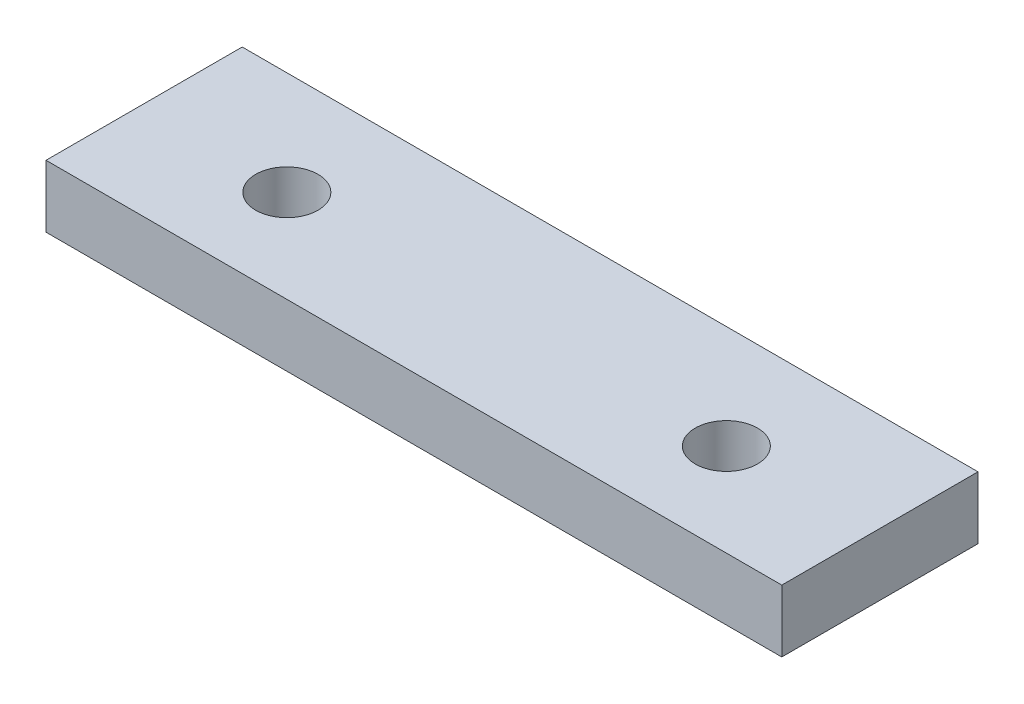
ISO-10303-21;
HEADER;
FILE_DESCRIPTION(('STEP AP214'),'2;1');
FILE_NAME('part.step','',(''),(''),'','','');
FILE_SCHEMA(('AUTOMOTIVE_DESIGN { 1 0 10303 214 1 1 1 1 }'));
ENDSEC;
DATA;
#1=APPLICATION_CONTEXT('core data for automotive mechanical design processes');
#2=APPLICATION_PROTOCOL_DEFINITION('international standard','automotive_design',2000,#1);
#3=PRODUCT_CONTEXT('',#1,'mechanical');
#4=PRODUCT('Part','Part','',(#3));
#5=PRODUCT_RELATED_PRODUCT_CATEGORY('part','',(#4));
#6=PRODUCT_DEFINITION_FORMATION('','',#4);
#7=PRODUCT_DEFINITION_CONTEXT('part definition',#1,'design');
#8=PRODUCT_DEFINITION('design','',#6,#7);
#9=PRODUCT_DEFINITION_SHAPE('','',#8);
#10=(LENGTH_UNIT() NAMED_UNIT(*) SI_UNIT(.MILLI.,.METRE.));
#11=(NAMED_UNIT(*) PLANE_ANGLE_UNIT() SI_UNIT($,.RADIAN.));
#12=(NAMED_UNIT(*) SI_UNIT($,.STERADIAN.) SOLID_ANGLE_UNIT());
#13=UNCERTAINTY_MEASURE_WITH_UNIT(LENGTH_MEASURE(1.E-05),#10,'distance_accuracy_value','');
#14=(GEOMETRIC_REPRESENTATION_CONTEXT(3) GLOBAL_UNCERTAINTY_ASSIGNED_CONTEXT((#13)) GLOBAL_UNIT_ASSIGNED_CONTEXT((#10,
#11,#12)) REPRESENTATION_CONTEXT('',''));
#15=CARTESIAN_POINT('',(0.,0.,0.));
#16=DIRECTION('',(0.,0.,1.));
#17=DIRECTION('',(1.,0.,0.));
#18=AXIS2_PLACEMENT_3D('',#15,#16,#17);
#19=CARTESIAN_POINT('',(150.,0.,0.));
#20=DIRECTION('',(0.,0.,-1.));
#21=DIRECTION('',(-1.,0.,0.));
#22=AXIS2_PLACEMENT_3D('',#19,#20,#21);
#23=PLANE('',#22);
#24=DIRECTION('',(0.,-1.,0.));
#25=VECTOR('',#24,1.);
#26=CARTESIAN_POINT('',(0.,0.,0.));
#27=LINE('',#26,#25);
#28=CARTESIAN_POINT('',(0.,12.7,0.));
#29=VERTEX_POINT('',#28);
#30=CARTESIAN_POINT('',(0.,0.,0.));
#31=VERTEX_POINT('',#30);
#32=EDGE_CURVE('E101',#29,#31,#27,.T.);
#33=ORIENTED_EDGE('',*,*,#32,.T.);
#34=DIRECTION('',(-1.,0.,0.));
#35=VECTOR('',#34,1.);
#36=CARTESIAN_POINT('',(150.,0.,0.));
#37=LINE('',#36,#35);
#38=CARTESIAN_POINT('',(150.,0.,0.));
#39=VERTEX_POINT('',#38);
#40=EDGE_CURVE('E11',#39,#31,#37,.T.);
#41=ORIENTED_EDGE('',*,*,#40,.F.);
#42=DIRECTION('',(0.,-1.,0.));
#43=VECTOR('',#42,1.);
#44=CARTESIAN_POINT('',(150.,0.,0.));
#45=LINE('',#44,#43);
#46=CARTESIAN_POINT('',(150.,12.7,0.));
#47=VERTEX_POINT('',#46);
#48=EDGE_CURVE('E89',#47,#39,#45,.T.);
#49=ORIENTED_EDGE('',*,*,#48,.F.);
#50=DIRECTION('',(-1.,0.,0.));
#51=VECTOR('',#50,1.);
#52=CARTESIAN_POINT('',(150.,12.7,0.));
#53=LINE('',#52,#51);
#54=EDGE_CURVE('E97',#47,#29,#53,.T.);
#55=ORIENTED_EDGE('',*,*,#54,.T.);
#56=EDGE_LOOP('',(#33,#41,#49,#55));
#57=FACE_BOUND('',#56,.T.);
#58=ADVANCED_FACE('F38',(#57),#23,.F.);
#59=CARTESIAN_POINT('',(150.,0.,0.));
#60=DIRECTION('',(0.,1.,0.));
#61=DIRECTION('',(0.,0.,1.));
#62=AXIS2_PLACEMENT_3D('',#59,#60,#61);
#63=PLANE('',#62);
#64=CARTESIAN_POINT('',(30.2,0.,-18.9));
#65=DIRECTION('',(0.,1.,0.));
#66=DIRECTION('',(0.,0.,1.));
#67=AXIS2_PLACEMENT_3D('',#64,#65,#66);
#68=CIRCLE('',#67,6.35000000000001);
#69=CARTESIAN_POINT('',(30.2,0.,-12.55));
#70=VERTEX_POINT('',#69);
#71=EDGE_CURVE('E104',#70,#70,#68,.F.);
#72=ORIENTED_EDGE('',*,*,#71,.F.);
#73=EDGE_LOOP('',(#72));
#74=FACE_BOUND('',#73,.T.);
#75=CARTESIAN_POINT('',(119.8,0.,-18.9));
#76=DIRECTION('',(0.,1.,0.));
#77=DIRECTION('',(0.,0.,1.));
#78=AXIS2_PLACEMENT_3D('',#75,#76,#77);
#79=CIRCLE('',#78,6.35);
#80=CARTESIAN_POINT('',(119.8,0.,-12.55));
#81=VERTEX_POINT('',#80);
#82=EDGE_CURVE('E115',#81,#81,#79,.F.);
#83=ORIENTED_EDGE('',*,*,#82,.F.);
#84=EDGE_LOOP('',(#83));
#85=FACE_BOUND('',#84,.T.);
#86=DIRECTION('',(0.,0.,-1.));
#87=VECTOR('',#86,1.);
#88=CARTESIAN_POINT('',(0.,0.,0.));
#89=LINE('',#88,#87);
#90=CARTESIAN_POINT('',(0.,0.,-40.));
#91=VERTEX_POINT('',#90);
#92=EDGE_CURVE('E93',#31,#91,#89,.T.);
#93=ORIENTED_EDGE('',*,*,#92,.T.);
#94=DIRECTION('',(-1.,0.,0.));
#95=VECTOR('',#94,1.);
#96=CARTESIAN_POINT('',(150.,0.,-40.));
#97=LINE('',#96,#95);
#98=CARTESIAN_POINT('',(150.,0.,-40.));
#99=VERTEX_POINT('',#98);
#100=EDGE_CURVE('E46',#99,#91,#97,.T.);
#101=ORIENTED_EDGE('',*,*,#100,.F.);
#102=DIRECTION('',(0.,0.,-1.));
#103=VECTOR('',#102,1.);
#104=CARTESIAN_POINT('',(150.,0.,0.));
#105=LINE('',#104,#103);
#106=EDGE_CURVE('E84',#39,#99,#105,.T.);
#107=ORIENTED_EDGE('',*,*,#106,.F.);
#108=ORIENTED_EDGE('',*,*,#40,.T.);
#109=EDGE_LOOP('',(#93,#101,#107,#108));
#110=FACE_BOUND('',#109,.T.);
#111=ADVANCED_FACE('F92',(#74,#85,#110),#63,.F.);
#112=CARTESIAN_POINT('',(150.,0.,-40.));
#113=DIRECTION('',(0.,0.,1.));
#114=DIRECTION('',(1.,0.,0.));
#115=AXIS2_PLACEMENT_3D('',#112,#113,#114);
#116=PLANE('',#115);
#117=DIRECTION('',(0.,1.,0.));
#118=VECTOR('',#117,1.);
#119=CARTESIAN_POINT('',(0.,0.,-40.));
#120=LINE('',#119,#118);
#121=CARTESIAN_POINT('',(0.,12.7,-40.));
#122=VERTEX_POINT('',#121);
#123=EDGE_CURVE('E71',#91,#122,#120,.T.);
#124=ORIENTED_EDGE('',*,*,#123,.T.);
#125=DIRECTION('',(-1.,0.,0.));
#126=VECTOR('',#125,1.);
#127=CARTESIAN_POINT('',(150.,12.7,-40.));
#128=LINE('',#127,#126);
#129=CARTESIAN_POINT('',(150.,12.7,-40.));
#130=VERTEX_POINT('',#129);
#131=EDGE_CURVE('E94',#130,#122,#128,.T.);
#132=ORIENTED_EDGE('',*,*,#131,.F.);
#133=DIRECTION('',(0.,1.,0.));
#134=VECTOR('',#133,1.);
#135=CARTESIAN_POINT('',(150.,0.,-40.));
#136=LINE('',#135,#134);
#137=EDGE_CURVE('E87',#99,#130,#136,.T.);
#138=ORIENTED_EDGE('',*,*,#137,.F.);
#139=ORIENTED_EDGE('',*,*,#100,.T.);
#140=EDGE_LOOP('',(#124,#132,#138,#139));
#141=FACE_BOUND('',#140,.T.);
#142=ADVANCED_FACE('F95',(#141),#116,.F.);
#143=CARTESIAN_POINT('',(150.,12.7,0.));
#144=DIRECTION('',(0.,-1.,0.));
#145=DIRECTION('',(0.,0.,-1.));
#146=AXIS2_PLACEMENT_3D('',#143,#144,#145);
#147=PLANE('',#146);
#148=CARTESIAN_POINT('',(30.2,12.7,-18.9));
#149=DIRECTION('',(0.,1.,0.));
#150=DIRECTION('',(0.,0.,1.));
#151=AXIS2_PLACEMENT_3D('',#148,#149,#150);
#152=CIRCLE('',#151,6.35000000000001);
#153=CARTESIAN_POINT('',(30.2,12.7,-12.55));
#154=VERTEX_POINT('',#153);
#155=EDGE_CURVE('E118',#154,#154,#152,.T.);
#156=ORIENTED_EDGE('',*,*,#155,.F.);
#157=EDGE_LOOP('',(#156));
#158=FACE_BOUND('',#157,.T.);
#159=CARTESIAN_POINT('',(119.8,12.7,-18.9));
#160=DIRECTION('',(0.,1.,0.));
#161=DIRECTION('',(0.,0.,1.));
#162=AXIS2_PLACEMENT_3D('',#159,#160,#161);
#163=CIRCLE('',#162,6.35);
#164=CARTESIAN_POINT('',(119.8,12.7,-12.55));
#165=VERTEX_POINT('',#164);
#166=EDGE_CURVE('E119',#165,#165,#163,.T.);
#167=ORIENTED_EDGE('',*,*,#166,.F.);
#168=EDGE_LOOP('',(#167));
#169=FACE_BOUND('',#168,.T.);
#170=DIRECTION('',(0.,0.,1.));
#171=VECTOR('',#170,1.);
#172=CARTESIAN_POINT('',(0.,12.7,0.));
#173=LINE('',#172,#171);
#174=EDGE_CURVE('E77',#122,#29,#173,.T.);
#175=ORIENTED_EDGE('',*,*,#174,.T.);
#176=ORIENTED_EDGE('',*,*,#54,.F.);
#177=DIRECTION('',(0.,0.,1.));
#178=VECTOR('',#177,1.);
#179=CARTESIAN_POINT('',(150.,12.7,0.));
#180=LINE('',#179,#178);
#181=EDGE_CURVE('E54',#130,#47,#180,.T.);
#182=ORIENTED_EDGE('',*,*,#181,.F.);
#183=ORIENTED_EDGE('',*,*,#131,.T.);
#184=EDGE_LOOP('',(#175,#176,#182,#183));
#185=FACE_BOUND('',#184,.T.);
#186=ADVANCED_FACE('F109',(#158,#169,#185),#147,.F.);
#187=CARTESIAN_POINT('',(150.,0.,0.));
#188=DIRECTION('',(-1.,0.,0.));
#189=DIRECTION('',(0.,0.,1.));
#190=AXIS2_PLACEMENT_3D('',#187,#188,#189);
#191=PLANE('',#190);
#192=ORIENTED_EDGE('',*,*,#48,.T.);
#193=ORIENTED_EDGE('',*,*,#106,.T.);
#194=ORIENTED_EDGE('',*,*,#137,.T.);
#195=ORIENTED_EDGE('',*,*,#181,.T.);
#196=EDGE_LOOP('',(#192,#193,#194,#195));
#197=FACE_BOUND('',#196,.T.);
#198=ADVANCED_FACE('F85',(#197),#191,.F.);
#199=CARTESIAN_POINT('',(0.,0.,0.));
#200=DIRECTION('',(-1.,0.,0.));
#201=DIRECTION('',(0.,0.,1.));
#202=AXIS2_PLACEMENT_3D('',#199,#200,#201);
#203=PLANE('',#202);
#204=ORIENTED_EDGE('',*,*,#32,.F.);
#205=ORIENTED_EDGE('',*,*,#174,.F.);
#206=ORIENTED_EDGE('',*,*,#123,.F.);
#207=ORIENTED_EDGE('',*,*,#92,.F.);
#208=EDGE_LOOP('',(#204,#205,#206,#207));
#209=FACE_BOUND('',#208,.T.);
#210=ADVANCED_FACE('F112',(#209),#203,.T.);
#211=CARTESIAN_POINT('',(119.8,-0.000999999999999265,-18.9));
#212=DIRECTION('',(0.,1.,0.));
#213=DIRECTION('',(0.,0.,1.));
#214=AXIS2_PLACEMENT_3D('',#211,#212,#213);
#215=CYLINDRICAL_SURFACE('',#214,6.35);
#216=ORIENTED_EDGE('',*,*,#166,.T.);
#217=EDGE_LOOP('',(#216));
#218=FACE_BOUND('',#217,.T.);
#219=ORIENTED_EDGE('',*,*,#82,.T.);
#220=EDGE_LOOP('',(#219));
#221=FACE_BOUND('',#220,.T.);
#222=ADVANCED_FACE('F135',(#218,#221),#215,.F.);
#223=CARTESIAN_POINT('',(30.2,-0.000999999999999265,-18.9));
#224=DIRECTION('',(0.,1.,0.));
#225=DIRECTION('',(0.,0.,1.));
#226=AXIS2_PLACEMENT_3D('',#223,#224,#225);
#227=CYLINDRICAL_SURFACE('',#226,6.35000000000001);
#228=ORIENTED_EDGE('',*,*,#155,.T.);
#229=EDGE_LOOP('',(#228));
#230=FACE_BOUND('',#229,.T.);
#231=ORIENTED_EDGE('',*,*,#71,.T.);
#232=EDGE_LOOP('',(#231));
#233=FACE_BOUND('',#232,.T.);
#234=ADVANCED_FACE('F127',(#230,#233),#227,.F.);
#235=CLOSED_SHELL('',(#58,#111,#142,#186,#198,#210,#222,#234));
#236=MANIFOLD_SOLID_BREP('B2',#235);
#237=ADVANCED_BREP_SHAPE_REPRESENTATION('',(#18,#236),#14);
#238=SHAPE_DEFINITION_REPRESENTATION(#9,#237);
ENDSEC;
END-ISO-10303-21;
